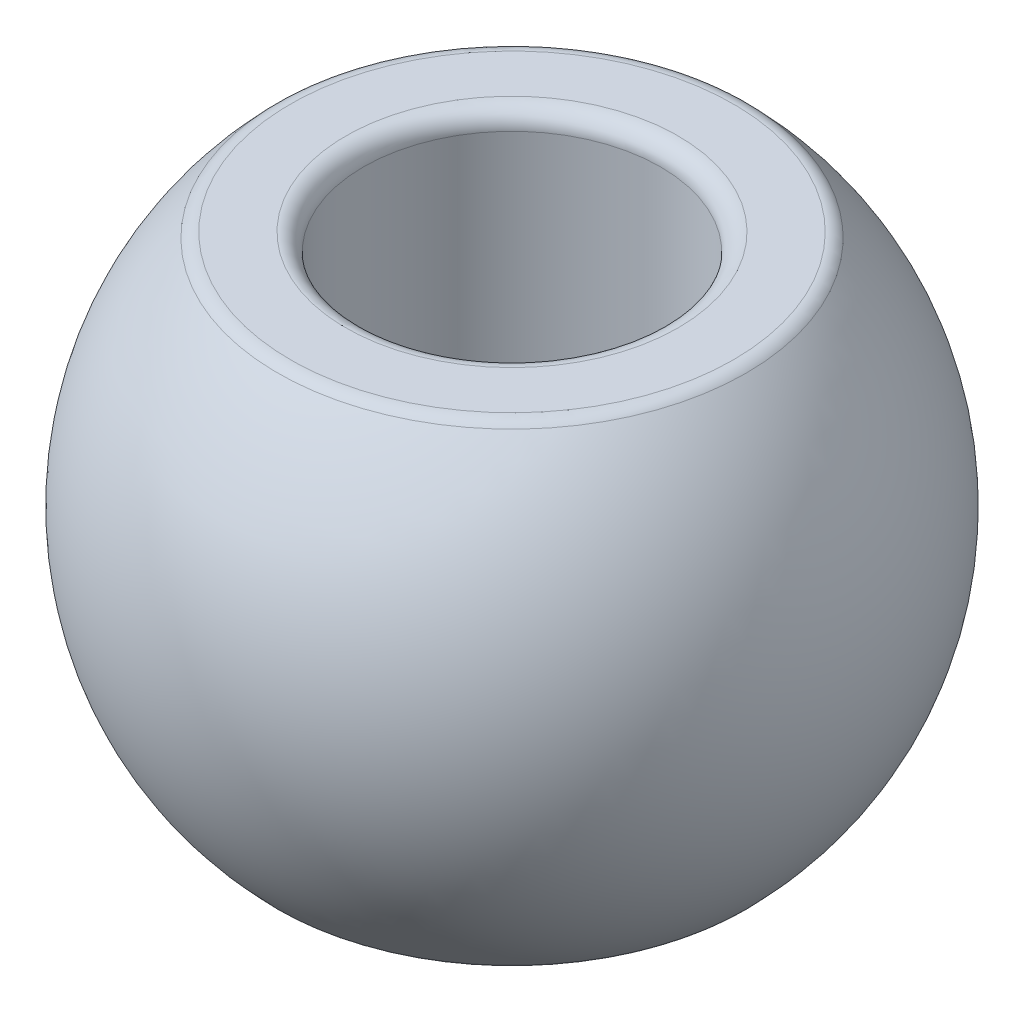
ISO-10303-21;
HEADER;
FILE_DESCRIPTION(('STEP AP214'),'2;1');
FILE_NAME('part.step','',(''),(''),'','','');
FILE_SCHEMA(('AUTOMOTIVE_DESIGN { 1 0 10303 214 1 1 1 1 }'));
ENDSEC;
DATA;
#1=APPLICATION_CONTEXT('core data for automotive mechanical design processes');
#2=APPLICATION_PROTOCOL_DEFINITION('international standard','automotive_design',2000,#1);
#3=PRODUCT_CONTEXT('',#1,'mechanical');
#4=PRODUCT('Part','Part','',(#3));
#5=PRODUCT_RELATED_PRODUCT_CATEGORY('part','',(#4));
#6=PRODUCT_DEFINITION_FORMATION('','',#4);
#7=PRODUCT_DEFINITION_CONTEXT('part definition',#1,'design');
#8=PRODUCT_DEFINITION('design','',#6,#7);
#9=PRODUCT_DEFINITION_SHAPE('','',#8);
#10=(LENGTH_UNIT() NAMED_UNIT(*) SI_UNIT(.MILLI.,.METRE.));
#11=(NAMED_UNIT(*) PLANE_ANGLE_UNIT() SI_UNIT($,.RADIAN.));
#12=(NAMED_UNIT(*) SI_UNIT($,.STERADIAN.) SOLID_ANGLE_UNIT());
#13=UNCERTAINTY_MEASURE_WITH_UNIT(LENGTH_MEASURE(1.E-05),#10,'distance_accuracy_value','');
#14=(GEOMETRIC_REPRESENTATION_CONTEXT(3) GLOBAL_UNCERTAINTY_ASSIGNED_CONTEXT((#13)) GLOBAL_UNIT_ASSIGNED_CONTEXT((#10,
#11,#12)) REPRESENTATION_CONTEXT('',''));
#15=CARTESIAN_POINT('',(0.,0.,0.));
#16=DIRECTION('',(0.,0.,1.));
#17=DIRECTION('',(1.,0.,0.));
#18=AXIS2_PLACEMENT_3D('',#15,#16,#17);
#19=CARTESIAN_POINT('',(0.,0.,0.));
#20=DIRECTION('',(0.,1.,0.));
#21=DIRECTION('',(1.,0.,0.));
#22=AXIS2_PLACEMENT_3D('',#19,#20,#21);
#23=SPHERICAL_SURFACE('',#22,5.555);
#24=CARTESIAN_POINT('',(0.,-3.91122740247383,0.));
#25=DIRECTION('',(0.,1.,0.));
#26=DIRECTION('',(-1.,0.,0.));
#27=AXIS2_PLACEMENT_3D('',#24,#25,#26);
#28=CIRCLE('',#27,3.9446578059621);
#29=CARTESIAN_POINT('',(-3.9446578059621,-3.91122740247384,0.));
#30=VERTEX_POINT('',#29);
#31=EDGE_CURVE('E71',#30,#30,#28,.T.);
#32=ORIENTED_EDGE('',*,*,#31,.T.);
#33=EDGE_LOOP('',(#32));
#34=FACE_BOUND('',#33,.T.);
#35=CARTESIAN_POINT('',(0.,3.91122740247383,0.));
#36=DIRECTION('',(0.,-1.,0.));
#37=DIRECTION('',(1.,0.,0.));
#38=AXIS2_PLACEMENT_3D('',#35,#36,#37);
#39=CIRCLE('',#38,3.94465780596211);
#40=CARTESIAN_POINT('',(3.94465780596211,3.91122740247384,0.));
#41=VERTEX_POINT('',#40);
#42=EDGE_CURVE('E75',#41,#41,#39,.T.);
#43=ORIENTED_EDGE('',*,*,#42,.T.);
#44=EDGE_LOOP('',(#43));
#45=FACE_BOUND('',#44,.T.);
#46=ADVANCED_FACE('F39',(#34,#45),#23,.T.);
#47=CARTESIAN_POINT('',(3.85461087530246,4.,0.));
#48=DIRECTION('',(0.,-1.,0.));
#49=DIRECTION('',(1.,0.,0.));
#50=AXIS2_PLACEMENT_3D('',#47,#48,#49);
#51=PLANE('',#50);
#52=CARTESIAN_POINT('',(0.,4.,0.));
#53=DIRECTION('',(0.,-1.,0.));
#54=DIRECTION('',(1.,0.,0.));
#55=AXIS2_PLACEMENT_3D('',#52,#53,#54);
#56=CIRCLE('',#55,3.73162498115767);
#57=CARTESIAN_POINT('',(3.73162498115767,4.,0.));
#58=VERTEX_POINT('',#57);
#59=EDGE_CURVE('E52',#58,#58,#56,.F.);
#60=ORIENTED_EDGE('',*,*,#59,.T.);
#61=EDGE_LOOP('',(#60));
#62=FACE_BOUND('',#61,.T.);
#63=CARTESIAN_POINT('',(0.,4.,0.));
#64=DIRECTION('',(0.,-1.,0.));
#65=DIRECTION('',(1.,0.,0.));
#66=AXIS2_PLACEMENT_3D('',#63,#64,#65);
#67=CIRCLE('',#66,2.8);
#68=CARTESIAN_POINT('',(2.8,4.,0.));
#69=VERTEX_POINT('',#68);
#70=EDGE_CURVE('E57',#69,#69,#67,.T.);
#71=ORIENTED_EDGE('',*,*,#70,.T.);
#72=EDGE_LOOP('',(#71));
#73=FACE_BOUND('',#72,.T.);
#74=ADVANCED_FACE('F89',(#62,#73),#51,.F.);
#75=CARTESIAN_POINT('',(0.,4.,0.));
#76=DIRECTION('',(0.,1.,0.));
#77=DIRECTION('',(-1.,0.,0.));
#78=AXIS2_PLACEMENT_3D('',#75,#76,#77);
#79=CYLINDRICAL_SURFACE('',#78,2.5);
#80=CARTESIAN_POINT('',(0.,3.7,0.));
#81=DIRECTION('',(0.,-1.,0.));
#82=DIRECTION('',(1.,0.,0.));
#83=AXIS2_PLACEMENT_3D('',#80,#81,#82);
#84=CIRCLE('',#83,2.5);
#85=CARTESIAN_POINT('',(2.5,3.7,0.));
#86=VERTEX_POINT('',#85);
#87=EDGE_CURVE('E10',#86,#86,#84,.F.);
#88=ORIENTED_EDGE('',*,*,#87,.T.);
#89=EDGE_LOOP('',(#88));
#90=FACE_BOUND('',#89,.T.);
#91=CARTESIAN_POINT('',(0.,-3.7,0.));
#92=DIRECTION('',(0.,1.,0.));
#93=DIRECTION('',(-1.,0.,0.));
#94=AXIS2_PLACEMENT_3D('',#91,#92,#93);
#95=CIRCLE('',#94,2.5);
#96=CARTESIAN_POINT('',(-2.5,-3.7,0.));
#97=VERTEX_POINT('',#96);
#98=EDGE_CURVE('E47',#97,#97,#95,.F.);
#99=ORIENTED_EDGE('',*,*,#98,.T.);
#100=EDGE_LOOP('',(#99));
#101=FACE_BOUND('',#100,.T.);
#102=ADVANCED_FACE('F92',(#90,#101),#79,.F.);
#103=CARTESIAN_POINT('',(2.5,-4.,0.));
#104=DIRECTION('',(0.,1.,0.));
#105=DIRECTION('',(-1.,0.,0.));
#106=AXIS2_PLACEMENT_3D('',#103,#104,#105);
#107=PLANE('',#106);
#108=CARTESIAN_POINT('',(0.,-4.,0.));
#109=DIRECTION('',(0.,1.,0.));
#110=DIRECTION('',(-1.,0.,0.));
#111=AXIS2_PLACEMENT_3D('',#108,#109,#110);
#112=CIRCLE('',#111,3.73162498115767);
#113=CARTESIAN_POINT('',(-3.73162498115767,-4.,0.));
#114=VERTEX_POINT('',#113);
#115=EDGE_CURVE('E63',#114,#114,#112,.F.);
#116=ORIENTED_EDGE('',*,*,#115,.T.);
#117=EDGE_LOOP('',(#116));
#118=FACE_BOUND('',#117,.T.);
#119=CARTESIAN_POINT('',(0.,-4.,0.));
#120=DIRECTION('',(0.,1.,0.));
#121=DIRECTION('',(-1.,0.,0.));
#122=AXIS2_PLACEMENT_3D('',#119,#120,#121);
#123=CIRCLE('',#122,2.8);
#124=CARTESIAN_POINT('',(-2.8,-4.,0.));
#125=VERTEX_POINT('',#124);
#126=EDGE_CURVE('E67',#125,#125,#123,.T.);
#127=ORIENTED_EDGE('',*,*,#126,.T.);
#128=EDGE_LOOP('',(#127));
#129=FACE_BOUND('',#128,.T.);
#130=ADVANCED_FACE('F110',(#118,#129),#107,.F.);
#131=CARTESIAN_POINT('',(0.,-3.7,0.));
#132=DIRECTION('',(0.,1.,0.));
#133=DIRECTION('',(-1.,0.,0.));
#134=AXIS2_PLACEMENT_3D('',#131,#132,#133);
#135=TOROIDAL_SURFACE('',#134,3.73162498115767,0.3);
#136=ORIENTED_EDGE('',*,*,#115,.F.);
#137=EDGE_LOOP('',(#136));
#138=FACE_BOUND('',#137,.T.);
#139=ORIENTED_EDGE('',*,*,#31,.F.);
#140=EDGE_LOOP('',(#139));
#141=FACE_BOUND('',#140,.T.);
#142=ADVANCED_FACE('F85',(#138,#141),#135,.T.);
#143=CARTESIAN_POINT('',(0.,3.7,0.));
#144=DIRECTION('',(0.,-1.,0.));
#145=DIRECTION('',(1.,0.,0.));
#146=AXIS2_PLACEMENT_3D('',#143,#144,#145);
#147=TOROIDAL_SURFACE('',#146,3.73162498115767,0.3);
#148=ORIENTED_EDGE('',*,*,#42,.F.);
#149=EDGE_LOOP('',(#148));
#150=FACE_BOUND('',#149,.T.);
#151=ORIENTED_EDGE('',*,*,#59,.F.);
#152=EDGE_LOOP('',(#151));
#153=FACE_BOUND('',#152,.T.);
#154=ADVANCED_FACE('F81',(#150,#153),#147,.T.);
#155=CARTESIAN_POINT('',(0.,3.7,0.));
#156=DIRECTION('',(0.,-1.,0.));
#157=DIRECTION('',(1.,0.,0.));
#158=AXIS2_PLACEMENT_3D('',#155,#156,#157);
#159=TOROIDAL_SURFACE('',#158,2.8,0.3);
#160=ORIENTED_EDGE('',*,*,#70,.F.);
#161=EDGE_LOOP('',(#160));
#162=FACE_BOUND('',#161,.T.);
#163=ORIENTED_EDGE('',*,*,#87,.F.);
#164=EDGE_LOOP('',(#163));
#165=FACE_BOUND('',#164,.T.);
#166=ADVANCED_FACE('F84',(#162,#165),#159,.T.);
#167=CARTESIAN_POINT('',(0.,-3.7,0.));
#168=DIRECTION('',(0.,1.,0.));
#169=DIRECTION('',(-1.,0.,0.));
#170=AXIS2_PLACEMENT_3D('',#167,#168,#169);
#171=TOROIDAL_SURFACE('',#170,2.8,0.3);
#172=ORIENTED_EDGE('',*,*,#98,.F.);
#173=EDGE_LOOP('',(#172));
#174=FACE_BOUND('',#173,.T.);
#175=ORIENTED_EDGE('',*,*,#126,.F.);
#176=EDGE_LOOP('',(#175));
#177=FACE_BOUND('',#176,.T.);
#178=ADVANCED_FACE('F41',(#174,#177),#171,.T.);
#179=CLOSED_SHELL('',(#46,#74,#102,#130,#142,#154,#166,#178));
#180=MANIFOLD_SOLID_BREP('B2',#179);
#181=ADVANCED_BREP_SHAPE_REPRESENTATION('',(#18,#180),#14);
#182=SHAPE_DEFINITION_REPRESENTATION(#9,#181);
ENDSEC;
END-ISO-10303-21;
